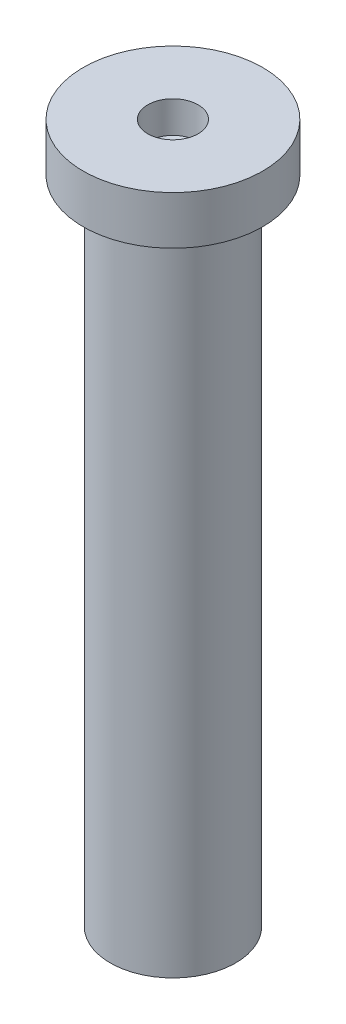
ISO-10303-21;
HEADER;
FILE_DESCRIPTION(('STEP AP214'),'2;1');
FILE_NAME('part.step','',(''),(''),'','','');
FILE_SCHEMA(('AUTOMOTIVE_DESIGN { 1 0 10303 214 1 1 1 1 }'));
ENDSEC;
DATA;
#1=APPLICATION_CONTEXT('core data for automotive mechanical design processes');
#2=APPLICATION_PROTOCOL_DEFINITION('international standard','automotive_design',2000,#1);
#3=PRODUCT_CONTEXT('',#1,'mechanical');
#4=PRODUCT('Part','Part','',(#3));
#5=PRODUCT_RELATED_PRODUCT_CATEGORY('part','',(#4));
#6=PRODUCT_DEFINITION_FORMATION('','',#4);
#7=PRODUCT_DEFINITION_CONTEXT('part definition',#1,'design');
#8=PRODUCT_DEFINITION('design','',#6,#7);
#9=PRODUCT_DEFINITION_SHAPE('','',#8);
#10=(LENGTH_UNIT() NAMED_UNIT(*) SI_UNIT(.MILLI.,.METRE.));
#11=(NAMED_UNIT(*) PLANE_ANGLE_UNIT() SI_UNIT($,.RADIAN.));
#12=(NAMED_UNIT(*) SI_UNIT($,.STERADIAN.) SOLID_ANGLE_UNIT());
#13=UNCERTAINTY_MEASURE_WITH_UNIT(LENGTH_MEASURE(1.E-05),#10,'distance_accuracy_value','');
#14=(GEOMETRIC_REPRESENTATION_CONTEXT(3) GLOBAL_UNCERTAINTY_ASSIGNED_CONTEXT((#13)) GLOBAL_UNIT_ASSIGNED_CONTEXT((#10,
#11,#12)) REPRESENTATION_CONTEXT('',''));
#15=CARTESIAN_POINT('',(0.,0.,0.));
#16=DIRECTION('',(0.,0.,1.));
#17=DIRECTION('',(1.,0.,0.));
#18=AXIS2_PLACEMENT_3D('',#15,#16,#17);
#19=CARTESIAN_POINT('',(0.,-1.55727891683496,0.));
#20=DIRECTION('',(0.,-1.,0.));
#21=DIRECTION('',(0.,0.,-1.));
#22=AXIS2_PLACEMENT_3D('',#19,#20,#21);
#23=PLANE('',#22);
#24=CARTESIAN_POINT('',(0.,-1.55727891683496,0.));
#25=DIRECTION('',(0.,-1.,0.));
#26=DIRECTION('',(0.,0.,-1.));
#27=AXIS2_PLACEMENT_3D('',#24,#25,#26);
#28=CIRCLE('',#27,1.3);
#29=CARTESIAN_POINT('',(0.,-1.55727891683496,-1.3));
#30=VERTEX_POINT('',#29);
#31=EDGE_CURVE('E11',#30,#30,#28,.T.);
#32=ORIENTED_EDGE('',*,*,#31,.T.);
#33=EDGE_LOOP('',(#32));
#34=FACE_BOUND('',#33,.T.);
#35=ADVANCED_FACE('F41',(#34),#23,.T.);
#36=CARTESIAN_POINT('',(0.,-1.55727891683496,0.));
#37=DIRECTION('',(0.,-1.,0.));
#38=DIRECTION('',(0.,0.,-1.));
#39=AXIS2_PLACEMENT_3D('',#36,#37,#38);
#40=CYLINDRICAL_SURFACE('',#39,1.3);
#41=CARTESIAN_POINT('',(0.,11.942721083165,0.));
#42=DIRECTION('',(0.,-1.,0.));
#43=DIRECTION('',(0.,0.,-1.));
#44=AXIS2_PLACEMENT_3D('',#41,#42,#43);
#45=CIRCLE('',#44,1.3);
#46=CARTESIAN_POINT('',(0.,11.942721083165,-1.3));
#47=VERTEX_POINT('',#46);
#48=EDGE_CURVE('E48',#47,#47,#45,.T.);
#49=ORIENTED_EDGE('',*,*,#48,.T.);
#50=EDGE_LOOP('',(#49));
#51=FACE_BOUND('',#50,.T.);
#52=ORIENTED_EDGE('',*,*,#31,.F.);
#53=EDGE_LOOP('',(#52));
#54=FACE_BOUND('',#53,.T.);
#55=ADVANCED_FACE('F78',(#51,#54),#40,.T.);
#56=CARTESIAN_POINT('',(1.3,11.942721083165,0.));
#57=DIRECTION('',(0.,-1.,0.));
#58=DIRECTION('',(0.,0.,-1.));
#59=AXIS2_PLACEMENT_3D('',#56,#57,#58);
#60=PLANE('',#59);
#61=CARTESIAN_POINT('',(0.,11.942721083165,0.));
#62=DIRECTION('',(0.,-1.,0.));
#63=DIRECTION('',(0.,0.,-1.));
#64=AXIS2_PLACEMENT_3D('',#61,#62,#63);
#65=CIRCLE('',#64,1.86144790437702);
#66=CARTESIAN_POINT('',(0.,11.942721083165,-1.86144790437702));
#67=VERTEX_POINT('',#66);
#68=EDGE_CURVE('E71',#67,#67,#65,.T.);
#69=ORIENTED_EDGE('',*,*,#68,.T.);
#70=EDGE_LOOP('',(#69));
#71=FACE_BOUND('',#70,.T.);
#72=ORIENTED_EDGE('',*,*,#48,.F.);
#73=EDGE_LOOP('',(#72));
#74=FACE_BOUND('',#73,.T.);
#75=ADVANCED_FACE('F81',(#71,#74),#60,.T.);
#76=CARTESIAN_POINT('',(0.,-1.55727891683496,0.));
#77=DIRECTION('',(0.,-1.,0.));
#78=DIRECTION('',(0.,0.,-1.));
#79=AXIS2_PLACEMENT_3D('',#76,#77,#78);
#80=CYLINDRICAL_SURFACE('',#79,1.86144790437702);
#81=CARTESIAN_POINT('',(0.,12.942721083165,0.));
#82=DIRECTION('',(0.,-1.,0.));
#83=DIRECTION('',(0.,0.,-1.));
#84=AXIS2_PLACEMENT_3D('',#81,#82,#83);
#85=CIRCLE('',#84,1.86144790437702);
#86=CARTESIAN_POINT('',(0.,12.942721083165,-1.86144790437702));
#87=VERTEX_POINT('',#86);
#88=EDGE_CURVE('E65',#87,#87,#85,.T.);
#89=ORIENTED_EDGE('',*,*,#88,.T.);
#90=EDGE_LOOP('',(#89));
#91=FACE_BOUND('',#90,.T.);
#92=ORIENTED_EDGE('',*,*,#68,.F.);
#93=EDGE_LOOP('',(#92));
#94=FACE_BOUND('',#93,.T.);
#95=ADVANCED_FACE('F83',(#91,#94),#80,.T.);
#96=CARTESIAN_POINT('',(1.86144790437702,12.942721083165,0.));
#97=DIRECTION('',(0.,1.,0.));
#98=DIRECTION('',(0.,0.,1.));
#99=AXIS2_PLACEMENT_3D('',#96,#97,#98);
#100=PLANE('',#99);
#101=CARTESIAN_POINT('',(0.,12.942721083165,0.));
#102=DIRECTION('',(0.,-1.,0.));
#103=DIRECTION('',(0.,0.,-1.));
#104=AXIS2_PLACEMENT_3D('',#101,#102,#103);
#105=CIRCLE('',#104,0.521941773484216);
#106=CARTESIAN_POINT('',(0.,12.942721083165,-0.521941773484216));
#107=VERTEX_POINT('',#106);
#108=EDGE_CURVE('E61',#107,#107,#105,.T.);
#109=ORIENTED_EDGE('',*,*,#108,.T.);
#110=EDGE_LOOP('',(#109));
#111=FACE_BOUND('',#110,.T.);
#112=ORIENTED_EDGE('',*,*,#88,.F.);
#113=EDGE_LOOP('',(#112));
#114=FACE_BOUND('',#113,.T.);
#115=ADVANCED_FACE('F90',(#111,#114),#100,.T.);
#116=CARTESIAN_POINT('',(0.,-1.55727891683496,0.));
#117=DIRECTION('',(0.,-1.,0.));
#118=DIRECTION('',(0.,0.,-1.));
#119=AXIS2_PLACEMENT_3D('',#116,#117,#118);
#120=CYLINDRICAL_SURFACE('',#119,0.521941773484216);
#121=CARTESIAN_POINT('',(0.,12.2841534616604,0.));
#122=DIRECTION('',(0.,-1.,0.));
#123=DIRECTION('',(0.,0.,-1.));
#124=AXIS2_PLACEMENT_3D('',#121,#122,#123);
#125=CIRCLE('',#124,0.521941773484216);
#126=CARTESIAN_POINT('',(0.,12.2841534616604,-0.521941773484216));
#127=VERTEX_POINT('',#126);
#128=EDGE_CURVE('E58',#127,#127,#125,.T.);
#129=ORIENTED_EDGE('',*,*,#128,.T.);
#130=EDGE_LOOP('',(#129));
#131=FACE_BOUND('',#130,.T.);
#132=ORIENTED_EDGE('',*,*,#108,.F.);
#133=EDGE_LOOP('',(#132));
#134=FACE_BOUND('',#133,.T.);
#135=ADVANCED_FACE('F54',(#131,#134),#120,.F.);
#136=CARTESIAN_POINT('',(0.,12.2841534616604,0.));
#137=DIRECTION('',(0.,1.,0.));
#138=DIRECTION('',(0.,0.,1.));
#139=AXIS2_PLACEMENT_3D('',#136,#137,#138);
#140=CONICAL_SURFACE('',#139,0.521941773484216,0.842622585181353);
#141=CARTESIAN_POINT('',(0.,11.8187724175787,0.));
#142=VERTEX_POINT('',#141);
#143=VERTEX_LOOP('',#142);
#144=FACE_BOUND('',#143,.T.);
#145=ORIENTED_EDGE('',*,*,#128,.F.);
#146=EDGE_LOOP('',(#145));
#147=FACE_BOUND('',#146,.T.);
#148=ADVANCED_FACE('F51',(#144,#147),#140,.F.);
#149=CLOSED_SHELL('',(#35,#55,#75,#95,#115,#135,#148));
#150=MANIFOLD_SOLID_BREP('B2',#149);
#151=ADVANCED_BREP_SHAPE_REPRESENTATION('',(#18,#150),#14);
#152=SHAPE_DEFINITION_REPRESENTATION(#9,#151);
ENDSEC;
END-ISO-10303-21;
